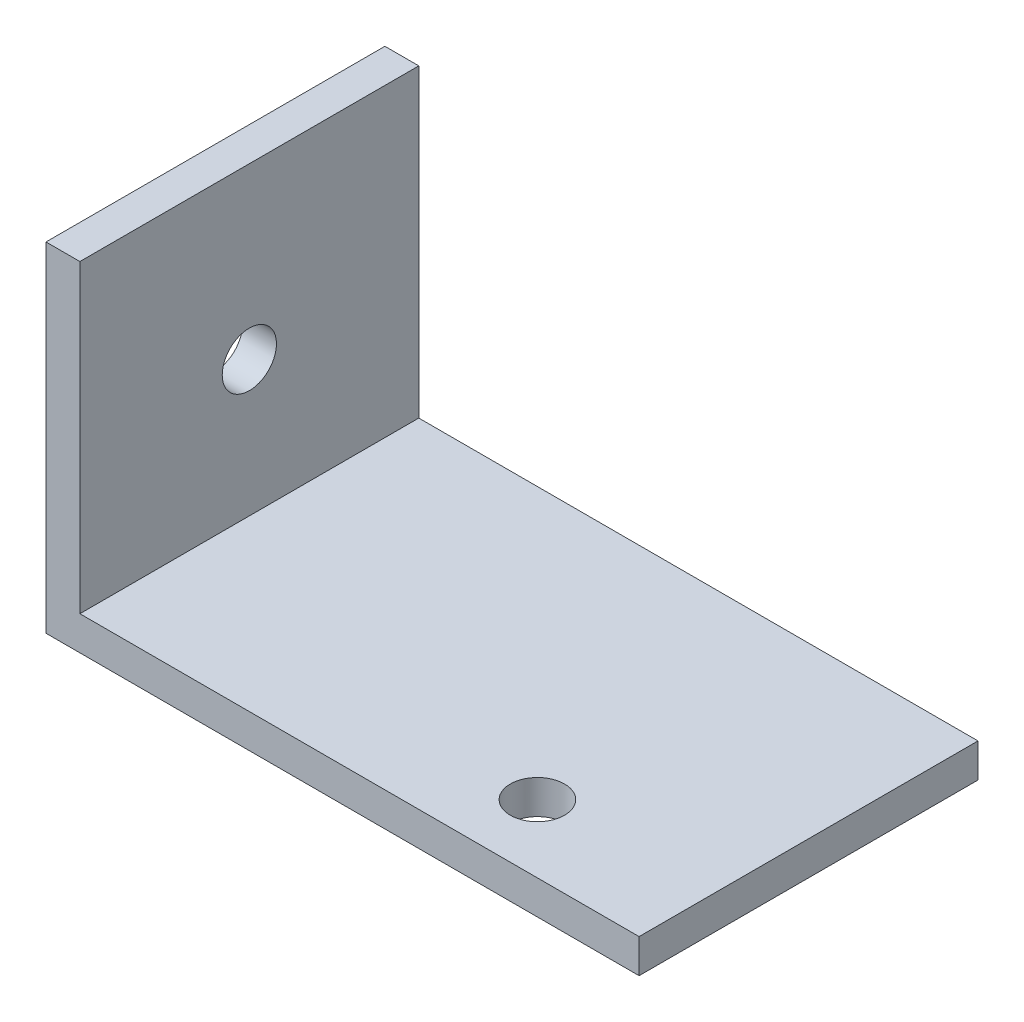
ISO-10303-21;
HEADER;
FILE_DESCRIPTION(('STEP AP214'),'2;1');
FILE_NAME('part.step','',(''),(''),'','','');
FILE_SCHEMA(('AUTOMOTIVE_DESIGN { 1 0 10303 214 1 1 1 1 }'));
ENDSEC;
DATA;
#1=APPLICATION_CONTEXT('core data for automotive mechanical design processes');
#2=APPLICATION_PROTOCOL_DEFINITION('international standard','automotive_design',2000,#1);
#3=PRODUCT_CONTEXT('',#1,'mechanical');
#4=PRODUCT('Part','Part','',(#3));
#5=PRODUCT_RELATED_PRODUCT_CATEGORY('part','',(#4));
#6=PRODUCT_DEFINITION_FORMATION('','',#4);
#7=PRODUCT_DEFINITION_CONTEXT('part definition',#1,'design');
#8=PRODUCT_DEFINITION('design','',#6,#7);
#9=PRODUCT_DEFINITION_SHAPE('','',#8);
#10=(LENGTH_UNIT() NAMED_UNIT(*) SI_UNIT(.MILLI.,.METRE.));
#11=(NAMED_UNIT(*) PLANE_ANGLE_UNIT() SI_UNIT($,.RADIAN.));
#12=(NAMED_UNIT(*) SI_UNIT($,.STERADIAN.) SOLID_ANGLE_UNIT());
#13=UNCERTAINTY_MEASURE_WITH_UNIT(LENGTH_MEASURE(1.E-05),#10,'distance_accuracy_value','');
#14=(GEOMETRIC_REPRESENTATION_CONTEXT(3) GLOBAL_UNCERTAINTY_ASSIGNED_CONTEXT((#13)) GLOBAL_UNIT_ASSIGNED_CONTEXT((#10,
#11,#12)) REPRESENTATION_CONTEXT('',''));
#15=CARTESIAN_POINT('',(0.,0.,0.));
#16=DIRECTION('',(0.,0.,1.));
#17=DIRECTION('',(1.,0.,0.));
#18=AXIS2_PLACEMENT_3D('',#15,#16,#17);
#19=CARTESIAN_POINT('',(0.,20.,20.));
#20=DIRECTION('',(1.,0.,0.));
#21=DIRECTION('',(0.,1.,0.));
#22=AXIS2_PLACEMENT_3D('',#19,#20,#21);
#23=PLANE('',#22);
#24=CARTESIAN_POINT('',(0.,10.,10.));
#25=DIRECTION('',(-1.,0.,0.));
#26=DIRECTION('',(0.,-1.,0.));
#27=AXIS2_PLACEMENT_3D('',#24,#25,#26);
#28=CIRCLE('',#27,1.6);
#29=CARTESIAN_POINT('',(0.,8.4,10.));
#30=VERTEX_POINT('',#29);
#31=EDGE_CURVE('E140',#30,#30,#28,.T.);
#32=ORIENTED_EDGE('',*,*,#31,.F.);
#33=EDGE_LOOP('',(#32));
#34=FACE_BOUND('',#33,.T.);
#35=DIRECTION('',(0.,-1.,0.));
#36=VECTOR('',#35,1.);
#37=CARTESIAN_POINT('',(0.,20.,0.));
#38=LINE('',#37,#36);
#39=CARTESIAN_POINT('',(0.,20.,0.));
#40=VERTEX_POINT('',#39);
#41=CARTESIAN_POINT('',(0.,0.,0.));
#42=VERTEX_POINT('',#41);
#43=EDGE_CURVE('E123',#40,#42,#38,.T.);
#44=ORIENTED_EDGE('',*,*,#43,.T.);
#45=DIRECTION('',(0.,0.,-1.));
#46=VECTOR('',#45,1.);
#47=CARTESIAN_POINT('',(0.,0.,20.));
#48=LINE('',#47,#46);
#49=CARTESIAN_POINT('',(0.,0.,20.));
#50=VERTEX_POINT('',#49);
#51=EDGE_CURVE('E11',#50,#42,#48,.T.);
#52=ORIENTED_EDGE('',*,*,#51,.F.);
#53=DIRECTION('',(0.,-1.,0.));
#54=VECTOR('',#53,1.);
#55=CARTESIAN_POINT('',(0.,20.,20.));
#56=LINE('',#55,#54);
#57=CARTESIAN_POINT('',(0.,20.,20.));
#58=VERTEX_POINT('',#57);
#59=EDGE_CURVE('E134',#58,#50,#56,.T.);
#60=ORIENTED_EDGE('',*,*,#59,.F.);
#61=DIRECTION('',(0.,0.,-1.));
#62=VECTOR('',#61,1.);
#63=CARTESIAN_POINT('',(0.,20.,20.));
#64=LINE('',#63,#62);
#65=EDGE_CURVE('E119',#58,#40,#64,.T.);
#66=ORIENTED_EDGE('',*,*,#65,.T.);
#67=EDGE_LOOP('',(#44,#52,#60,#66));
#68=FACE_BOUND('',#67,.T.);
#69=ADVANCED_FACE('F37',(#34,#68),#23,.F.);
#70=CARTESIAN_POINT('',(0.,0.,20.));
#71=DIRECTION('',(0.,1.,0.));
#72=DIRECTION('',(0.,0.,1.));
#73=AXIS2_PLACEMENT_3D('',#70,#71,#72);
#74=PLANE('',#73);
#75=CARTESIAN_POINT('',(25.,0.,16.));
#76=DIRECTION('',(0.,-1.,0.));
#77=DIRECTION('',(0.,0.,-1.));
#78=AXIS2_PLACEMENT_3D('',#75,#76,#77);
#79=CIRCLE('',#78,1.6);
#80=CARTESIAN_POINT('',(25.,0.,14.4));
#81=VERTEX_POINT('',#80);
#82=EDGE_CURVE('E148',#81,#81,#79,.T.);
#83=ORIENTED_EDGE('',*,*,#82,.F.);
#84=EDGE_LOOP('',(#83));
#85=FACE_BOUND('',#84,.T.);
#86=DIRECTION('',(1.,0.,0.));
#87=VECTOR('',#86,1.);
#88=CARTESIAN_POINT('',(0.,0.,0.));
#89=LINE('',#88,#87);
#90=CARTESIAN_POINT('',(35.,0.,0.));
#91=VERTEX_POINT('',#90);
#92=EDGE_CURVE('E126',#42,#91,#89,.T.);
#93=ORIENTED_EDGE('',*,*,#92,.T.);
#94=DIRECTION('',(0.,0.,-1.));
#95=VECTOR('',#94,1.);
#96=CARTESIAN_POINT('',(35.,0.,20.));
#97=LINE('',#96,#95);
#98=CARTESIAN_POINT('',(35.,0.,20.));
#99=VERTEX_POINT('',#98);
#100=EDGE_CURVE('E46',#99,#91,#97,.T.);
#101=ORIENTED_EDGE('',*,*,#100,.F.);
#102=DIRECTION('',(1.,0.,0.));
#103=VECTOR('',#102,1.);
#104=CARTESIAN_POINT('',(0.,0.,20.));
#105=LINE('',#104,#103);
#106=EDGE_CURVE('E92',#50,#99,#105,.T.);
#107=ORIENTED_EDGE('',*,*,#106,.F.);
#108=ORIENTED_EDGE('',*,*,#51,.T.);
#109=EDGE_LOOP('',(#93,#101,#107,#108));
#110=FACE_BOUND('',#109,.T.);
#111=ADVANCED_FACE('F154',(#85,#110),#74,.F.);
#112=CARTESIAN_POINT('',(35.,0.,20.));
#113=DIRECTION('',(-1.,0.,0.));
#114=DIRECTION('',(0.,0.,1.));
#115=AXIS2_PLACEMENT_3D('',#112,#113,#114);
#116=PLANE('',#115);
#117=DIRECTION('',(0.,1.,0.));
#118=VECTOR('',#117,1.);
#119=CARTESIAN_POINT('',(35.,0.,0.));
#120=LINE('',#119,#118);
#121=CARTESIAN_POINT('',(35.,2.,0.));
#122=VERTEX_POINT('',#121);
#123=EDGE_CURVE('E129',#91,#122,#120,.T.);
#124=ORIENTED_EDGE('',*,*,#123,.T.);
#125=DIRECTION('',(0.,0.,-1.));
#126=VECTOR('',#125,1.);
#127=CARTESIAN_POINT('',(35.,2.,20.));
#128=LINE('',#127,#126);
#129=CARTESIAN_POINT('',(35.,2.,20.));
#130=VERTEX_POINT('',#129);
#131=EDGE_CURVE('E114',#130,#122,#128,.T.);
#132=ORIENTED_EDGE('',*,*,#131,.F.);
#133=DIRECTION('',(0.,1.,0.));
#134=VECTOR('',#133,1.);
#135=CARTESIAN_POINT('',(35.,0.,20.));
#136=LINE('',#135,#134);
#137=EDGE_CURVE('E105',#99,#130,#136,.T.);
#138=ORIENTED_EDGE('',*,*,#137,.F.);
#139=ORIENTED_EDGE('',*,*,#100,.T.);
#140=EDGE_LOOP('',(#124,#132,#138,#139));
#141=FACE_BOUND('',#140,.T.);
#142=ADVANCED_FACE('F157',(#141),#116,.F.);
#143=CARTESIAN_POINT('',(35.,2.,20.));
#144=DIRECTION('',(0.,-1.,0.));
#145=DIRECTION('',(1.,0.,0.));
#146=AXIS2_PLACEMENT_3D('',#143,#144,#145);
#147=PLANE('',#146);
#148=CARTESIAN_POINT('',(25.,2.,16.));
#149=DIRECTION('',(0.,-1.,0.));
#150=DIRECTION('',(1.,0.,0.));
#151=AXIS2_PLACEMENT_3D('',#148,#149,#150);
#152=CIRCLE('',#151,1.6);
#153=CARTESIAN_POINT('',(26.6,2.,16.));
#154=VERTEX_POINT('',#153);
#155=EDGE_CURVE('E40',#154,#154,#152,.T.);
#156=ORIENTED_EDGE('',*,*,#155,.T.);
#157=EDGE_LOOP('',(#156));
#158=FACE_BOUND('',#157,.T.);
#159=DIRECTION('',(-1.,0.,0.));
#160=VECTOR('',#159,1.);
#161=CARTESIAN_POINT('',(35.,2.,0.));
#162=LINE('',#161,#160);
#163=CARTESIAN_POINT('',(2.,2.,0.));
#164=VERTEX_POINT('',#163);
#165=EDGE_CURVE('E113',#122,#164,#162,.T.);
#166=ORIENTED_EDGE('',*,*,#165,.T.);
#167=DIRECTION('',(0.,0.,-1.));
#168=VECTOR('',#167,1.);
#169=CARTESIAN_POINT('',(2.,2.,20.));
#170=LINE('',#169,#168);
#171=CARTESIAN_POINT('',(2.,2.,20.));
#172=VERTEX_POINT('',#171);
#173=EDGE_CURVE('E110',#172,#164,#170,.T.);
#174=ORIENTED_EDGE('',*,*,#173,.F.);
#175=DIRECTION('',(-1.,0.,0.));
#176=VECTOR('',#175,1.);
#177=CARTESIAN_POINT('',(35.,2.,20.));
#178=LINE('',#177,#176);
#179=EDGE_CURVE('E99',#130,#172,#178,.T.);
#180=ORIENTED_EDGE('',*,*,#179,.F.);
#181=ORIENTED_EDGE('',*,*,#131,.T.);
#182=EDGE_LOOP('',(#166,#174,#180,#181));
#183=FACE_BOUND('',#182,.T.);
#184=ADVANCED_FACE('F111',(#158,#183),#147,.F.);
#185=CARTESIAN_POINT('',(2.,2.,20.));
#186=DIRECTION('',(-1.,0.,0.));
#187=DIRECTION('',(0.,0.,1.));
#188=AXIS2_PLACEMENT_3D('',#185,#186,#187);
#189=PLANE('',#188);
#190=CARTESIAN_POINT('',(2.,10.,10.));
#191=DIRECTION('',(-1.,0.,0.));
#192=DIRECTION('',(0.,0.,1.));
#193=AXIS2_PLACEMENT_3D('',#190,#191,#192);
#194=CIRCLE('',#193,1.6);
#195=CARTESIAN_POINT('',(2.,10.,11.6));
#196=VERTEX_POINT('',#195);
#197=EDGE_CURVE('E127',#196,#196,#194,.T.);
#198=ORIENTED_EDGE('',*,*,#197,.T.);
#199=EDGE_LOOP('',(#198));
#200=FACE_BOUND('',#199,.T.);
#201=DIRECTION('',(0.,1.,0.));
#202=VECTOR('',#201,1.);
#203=CARTESIAN_POINT('',(2.,2.,0.));
#204=LINE('',#203,#202);
#205=CARTESIAN_POINT('',(2.,20.,0.));
#206=VERTEX_POINT('',#205);
#207=EDGE_CURVE('E78',#164,#206,#204,.T.);
#208=ORIENTED_EDGE('',*,*,#207,.T.);
#209=DIRECTION('',(0.,0.,-1.));
#210=VECTOR('',#209,1.);
#211=CARTESIAN_POINT('',(2.,20.,20.));
#212=LINE('',#211,#210);
#213=CARTESIAN_POINT('',(2.,20.,20.));
#214=VERTEX_POINT('',#213);
#215=EDGE_CURVE('E115',#214,#206,#212,.T.);
#216=ORIENTED_EDGE('',*,*,#215,.F.);
#217=DIRECTION('',(0.,1.,0.));
#218=VECTOR('',#217,1.);
#219=CARTESIAN_POINT('',(2.,2.,20.));
#220=LINE('',#219,#218);
#221=EDGE_CURVE('E103',#172,#214,#220,.T.);
#222=ORIENTED_EDGE('',*,*,#221,.F.);
#223=ORIENTED_EDGE('',*,*,#173,.T.);
#224=EDGE_LOOP('',(#208,#216,#222,#223));
#225=FACE_BOUND('',#224,.T.);
#226=ADVANCED_FACE('F117',(#200,#225),#189,.F.);
#227=CARTESIAN_POINT('',(2.,20.,20.));
#228=DIRECTION('',(0.,-1.,0.));
#229=DIRECTION('',(0.,0.,-1.));
#230=AXIS2_PLACEMENT_3D('',#227,#228,#229);
#231=PLANE('',#230);
#232=DIRECTION('',(-1.,0.,0.));
#233=VECTOR('',#232,1.);
#234=CARTESIAN_POINT('',(2.,20.,0.));
#235=LINE('',#234,#233);
#236=EDGE_CURVE('E84',#206,#40,#235,.T.);
#237=ORIENTED_EDGE('',*,*,#236,.T.);
#238=ORIENTED_EDGE('',*,*,#65,.F.);
#239=DIRECTION('',(-1.,0.,0.));
#240=VECTOR('',#239,1.);
#241=CARTESIAN_POINT('',(2.,20.,20.));
#242=LINE('',#241,#240);
#243=EDGE_CURVE('E55',#214,#58,#242,.T.);
#244=ORIENTED_EDGE('',*,*,#243,.F.);
#245=ORIENTED_EDGE('',*,*,#215,.T.);
#246=EDGE_LOOP('',(#237,#238,#244,#245));
#247=FACE_BOUND('',#246,.T.);
#248=ADVANCED_FACE('F162',(#247),#231,.F.);
#249=CARTESIAN_POINT('',(0.,0.,20.));
#250=DIRECTION('',(0.,0.,1.));
#251=DIRECTION('',(1.,0.,0.));
#252=AXIS2_PLACEMENT_3D('',#249,#250,#251);
#253=PLANE('',#252);
#254=ORIENTED_EDGE('',*,*,#59,.T.);
#255=ORIENTED_EDGE('',*,*,#106,.T.);
#256=ORIENTED_EDGE('',*,*,#137,.T.);
#257=ORIENTED_EDGE('',*,*,#179,.T.);
#258=ORIENTED_EDGE('',*,*,#221,.T.);
#259=ORIENTED_EDGE('',*,*,#243,.T.);
#260=EDGE_LOOP('',(#254,#255,#256,#257,#258,#259));
#261=FACE_BOUND('',#260,.T.);
#262=ADVANCED_FACE('F101',(#261),#253,.T.);
#263=CARTESIAN_POINT('',(0.,0.,0.));
#264=DIRECTION('',(0.,0.,1.));
#265=DIRECTION('',(1.,0.,0.));
#266=AXIS2_PLACEMENT_3D('',#263,#264,#265);
#267=PLANE('',#266);
#268=ORIENTED_EDGE('',*,*,#43,.F.);
#269=ORIENTED_EDGE('',*,*,#236,.F.);
#270=ORIENTED_EDGE('',*,*,#207,.F.);
#271=ORIENTED_EDGE('',*,*,#165,.F.);
#272=ORIENTED_EDGE('',*,*,#123,.F.);
#273=ORIENTED_EDGE('',*,*,#92,.F.);
#274=EDGE_LOOP('',(#268,#269,#270,#271,#272,#273));
#275=FACE_BOUND('',#274,.T.);
#276=ADVANCED_FACE('F160',(#275),#267,.F.);
#277=CARTESIAN_POINT('',(35.,10.,10.));
#278=DIRECTION('',(-1.,0.,0.));
#279=DIRECTION('',(0.,-1.,0.));
#280=AXIS2_PLACEMENT_3D('',#277,#278,#279);
#281=CYLINDRICAL_SURFACE('',#280,1.6);
#282=ORIENTED_EDGE('',*,*,#31,.T.);
#283=EDGE_LOOP('',(#282));
#284=FACE_BOUND('',#283,.T.);
#285=ORIENTED_EDGE('',*,*,#197,.F.);
#286=EDGE_LOOP('',(#285));
#287=FACE_BOUND('',#286,.T.);
#288=ADVANCED_FACE('F194',(#284,#287),#281,.F.);
#289=CARTESIAN_POINT('',(25.,20.,16.));
#290=DIRECTION('',(0.,-1.,0.));
#291=DIRECTION('',(0.,0.,-1.));
#292=AXIS2_PLACEMENT_3D('',#289,#290,#291);
#293=CYLINDRICAL_SURFACE('',#292,1.6);
#294=ORIENTED_EDGE('',*,*,#82,.T.);
#295=EDGE_LOOP('',(#294));
#296=FACE_BOUND('',#295,.T.);
#297=ORIENTED_EDGE('',*,*,#155,.F.);
#298=EDGE_LOOP('',(#297));
#299=FACE_BOUND('',#298,.T.);
#300=ADVANCED_FACE('F192',(#296,#299),#293,.F.);
#301=CLOSED_SHELL('',(#69,#111,#142,#184,#226,#248,#262,#276,#288,#300));
#302=MANIFOLD_SOLID_BREP('B2',#301);
#303=ADVANCED_BREP_SHAPE_REPRESENTATION('',(#18,#302),#14);
#304=SHAPE_DEFINITION_REPRESENTATION(#9,#303);
ENDSEC;
END-ISO-10303-21;
